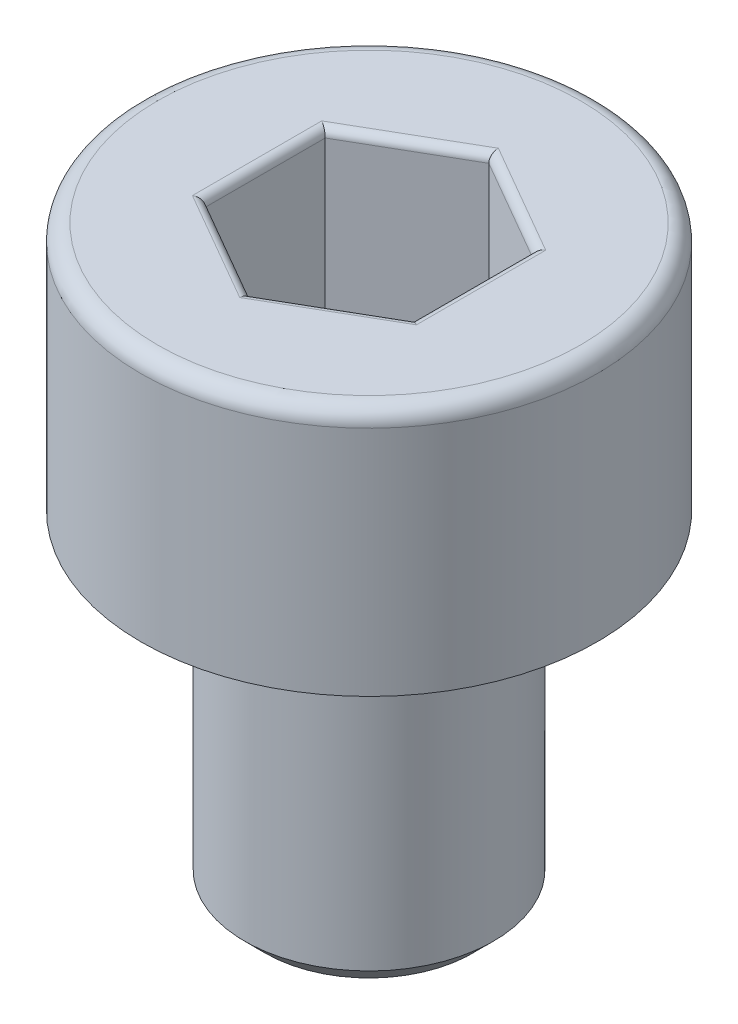
ISO-10303-21;
HEADER;
FILE_DESCRIPTION(('STEP AP214'),'2;1');
FILE_NAME('part.step','',(''),(''),'','','');
FILE_SCHEMA(('AUTOMOTIVE_DESIGN { 1 0 10303 214 1 1 1 1 }'));
ENDSEC;
DATA;
#1=APPLICATION_CONTEXT('core data for automotive mechanical design processes');
#2=APPLICATION_PROTOCOL_DEFINITION('international standard','automotive_design',2000,#1);
#3=PRODUCT_CONTEXT('',#1,'mechanical');
#4=PRODUCT('Part','Part','',(#3));
#5=PRODUCT_RELATED_PRODUCT_CATEGORY('part','',(#4));
#6=PRODUCT_DEFINITION_FORMATION('','',#4);
#7=PRODUCT_DEFINITION_CONTEXT('part definition',#1,'design');
#8=PRODUCT_DEFINITION('design','',#6,#7);
#9=PRODUCT_DEFINITION_SHAPE('','',#8);
#10=(LENGTH_UNIT() NAMED_UNIT(*) SI_UNIT(.MILLI.,.METRE.));
#11=(NAMED_UNIT(*) PLANE_ANGLE_UNIT() SI_UNIT($,.RADIAN.));
#12=(NAMED_UNIT(*) SI_UNIT($,.STERADIAN.) SOLID_ANGLE_UNIT());
#13=UNCERTAINTY_MEASURE_WITH_UNIT(LENGTH_MEASURE(1.E-05),#10,'distance_accuracy_value','');
#14=(GEOMETRIC_REPRESENTATION_CONTEXT(3) GLOBAL_UNCERTAINTY_ASSIGNED_CONTEXT((#13)) GLOBAL_UNIT_ASSIGNED_CONTEXT((#10,
#11,#12)) REPRESENTATION_CONTEXT('',''));
#15=CARTESIAN_POINT('',(0.,0.,0.));
#16=DIRECTION('',(0.,0.,1.));
#17=DIRECTION('',(1.,0.,0.));
#18=AXIS2_PLACEMENT_3D('',#15,#16,#17);
#19=CARTESIAN_POINT('',(0.,-7.,0.));
#20=DIRECTION('',(0.,-1.,0.));
#21=DIRECTION('',(0.,0.,-1.));
#22=AXIS2_PLACEMENT_3D('',#19,#20,#21);
#23=PLANE('',#22);
#24=CARTESIAN_POINT('',(0.,-7.,0.));
#25=DIRECTION('',(0.,-1.,0.));
#26=DIRECTION('',(0.,0.,-1.));
#27=AXIS2_PLACEMENT_3D('',#24,#25,#26);
#28=CIRCLE('',#27,1.25);
#29=CARTESIAN_POINT('',(0.,-7.,-1.25));
#30=VERTEX_POINT('',#29);
#31=EDGE_CURVE('E263',#30,#30,#28,.T.);
#32=ORIENTED_EDGE('',*,*,#31,.T.);
#33=EDGE_LOOP('',(#32));
#34=FACE_BOUND('',#33,.T.);
#35=ADVANCED_FACE('F35',(#34),#23,.T.);
#36=CARTESIAN_POINT('',(0.,0.,0.));
#37=DIRECTION('',(0.,1.,0.));
#38=DIRECTION('',(0.,0.,1.));
#39=AXIS2_PLACEMENT_3D('',#36,#37,#38);
#40=CYLINDRICAL_SURFACE('',#39,1.5);
#41=CARTESIAN_POINT('',(0.,-3.25,0.));
#42=DIRECTION('',(0.,-1.,0.));
#43=DIRECTION('',(0.,0.,-1.));
#44=AXIS2_PLACEMENT_3D('',#41,#42,#43);
#45=CIRCLE('',#44,1.5);
#46=CARTESIAN_POINT('',(0.,-3.25,-1.5));
#47=VERTEX_POINT('',#46);
#48=EDGE_CURVE('E260',#47,#47,#45,.T.);
#49=ORIENTED_EDGE('',*,*,#48,.T.);
#50=EDGE_LOOP('',(#49));
#51=FACE_BOUND('',#50,.T.);
#52=CARTESIAN_POINT('',(0.,-6.75,0.));
#53=DIRECTION('',(0.,-1.,0.));
#54=DIRECTION('',(0.,0.,-1.));
#55=AXIS2_PLACEMENT_3D('',#52,#53,#54);
#56=CIRCLE('',#55,1.5);
#57=CARTESIAN_POINT('',(0.,-6.75,-1.5));
#58=VERTEX_POINT('',#57);
#59=EDGE_CURVE('E257',#58,#58,#56,.F.);
#60=ORIENTED_EDGE('',*,*,#59,.T.);
#61=EDGE_LOOP('',(#60));
#62=FACE_BOUND('',#61,.T.);
#63=ADVANCED_FACE('F289',(#51,#62),#40,.T.);
#64=CARTESIAN_POINT('',(-1.5,-3.,0.));
#65=DIRECTION('',(0.,-1.,0.));
#66=DIRECTION('',(0.,0.,-1.));
#67=AXIS2_PLACEMENT_3D('',#64,#65,#66);
#68=PLANE('',#67);
#69=CARTESIAN_POINT('',(0.,-3.,0.));
#70=DIRECTION('',(0.,-1.,0.));
#71=DIRECTION('',(0.,0.,-1.));
#72=AXIS2_PLACEMENT_3D('',#69,#70,#71);
#73=CIRCLE('',#72,1.75);
#74=CARTESIAN_POINT('',(0.,-3.,-1.75));
#75=VERTEX_POINT('',#74);
#76=EDGE_CURVE('E254',#75,#75,#73,.F.);
#77=ORIENTED_EDGE('',*,*,#76,.T.);
#78=EDGE_LOOP('',(#77));
#79=FACE_BOUND('',#78,.T.);
#80=CARTESIAN_POINT('',(0.,-3.,0.));
#81=DIRECTION('',(0.,1.,0.));
#82=DIRECTION('',(0.,0.,1.));
#83=AXIS2_PLACEMENT_3D('',#80,#81,#82);
#84=CIRCLE('',#83,2.75);
#85=CARTESIAN_POINT('',(0.,-3.,2.75));
#86=VERTEX_POINT('',#85);
#87=EDGE_CURVE('E251',#86,#86,#84,.T.);
#88=ORIENTED_EDGE('',*,*,#87,.F.);
#89=EDGE_LOOP('',(#88));
#90=FACE_BOUND('',#89,.T.);
#91=ADVANCED_FACE('F295',(#79,#90),#68,.T.);
#92=CARTESIAN_POINT('',(0.,0.,0.));
#93=DIRECTION('',(0.,1.,0.));
#94=DIRECTION('',(0.,0.,1.));
#95=AXIS2_PLACEMENT_3D('',#92,#93,#94);
#96=CYLINDRICAL_SURFACE('',#95,2.75);
#97=CARTESIAN_POINT('',(0.,-0.2,0.));
#98=DIRECTION('',(0.,1.,0.));
#99=DIRECTION('',(0.,0.,1.));
#100=AXIS2_PLACEMENT_3D('',#97,#98,#99);
#101=CIRCLE('',#100,2.75);
#102=CARTESIAN_POINT('',(0.,-0.2,2.75));
#103=VERTEX_POINT('',#102);
#104=EDGE_CURVE('E161',#103,#103,#101,.F.);
#105=ORIENTED_EDGE('',*,*,#104,.T.);
#106=EDGE_LOOP('',(#105));
#107=FACE_BOUND('',#106,.T.);
#108=ORIENTED_EDGE('',*,*,#87,.T.);
#109=EDGE_LOOP('',(#108));
#110=FACE_BOUND('',#109,.T.);
#111=ADVANCED_FACE('F305',(#107,#110),#96,.T.);
#112=CARTESIAN_POINT('',(-2.75,0.,0.));
#113=DIRECTION('',(0.,1.,0.));
#114=DIRECTION('',(0.,0.,1.));
#115=AXIS2_PLACEMENT_3D('',#112,#113,#114);
#116=PLANE('',#115);
#117=DIRECTION('',(0.,0.,1.));
#118=VECTOR('',#117,1.);
#119=CARTESIAN_POINT('',(-1.35,0.,-0.721687836487033));
#120=LINE('',#119,#118);
#121=CARTESIAN_POINT('',(-1.35,0.,0.779422863405995));
#122=VERTEX_POINT('',#121);
#123=CARTESIAN_POINT('',(-1.35,0.,-0.779422863405995));
#124=VERTEX_POINT('',#123);
#125=EDGE_CURVE('E177',#122,#124,#120,.F.);
#126=ORIENTED_EDGE('',*,*,#125,.T.);
#127=DIRECTION('',(-0.866025403784439,0.,0.5));
#128=VECTOR('',#127,1.);
#129=CARTESIAN_POINT('',(-0.0500000000000002,0.,-1.52997821335251));
#130=LINE('',#129,#128);
#131=CARTESIAN_POINT('',(0.,0.,-1.55884572681199));
#132=VERTEX_POINT('',#131);
#133=EDGE_CURVE('E136',#124,#132,#130,.F.);
#134=ORIENTED_EDGE('',*,*,#133,.T.);
#135=DIRECTION('',(-0.866025403784439,0.,-0.5));
#136=VECTOR('',#135,1.);
#137=CARTESIAN_POINT('',(1.3,0.,-0.808290376865477));
#138=LINE('',#137,#136);
#139=CARTESIAN_POINT('',(1.35,0.,-0.779422863405995));
#140=VERTEX_POINT('',#139);
#141=EDGE_CURVE('E163',#132,#140,#138,.F.);
#142=ORIENTED_EDGE('',*,*,#141,.T.);
#143=DIRECTION('',(0.,0.,-1.));
#144=VECTOR('',#143,1.);
#145=CARTESIAN_POINT('',(1.35,0.,0.721687836487034));
#146=LINE('',#145,#144);
#147=CARTESIAN_POINT('',(1.35,0.,0.779422863405996));
#148=VERTEX_POINT('',#147);
#149=EDGE_CURVE('E171',#140,#148,#146,.F.);
#150=ORIENTED_EDGE('',*,*,#149,.T.);
#151=DIRECTION('',(0.866025403784439,0.,-0.5));
#152=VECTOR('',#151,1.);
#153=CARTESIAN_POINT('',(0.05,0.,1.52997821335251));
#154=LINE('',#153,#152);
#155=CARTESIAN_POINT('',(0.,0.,1.55884572681199));
#156=VERTEX_POINT('',#155);
#157=EDGE_CURVE('E173',#148,#156,#154,.F.);
#158=ORIENTED_EDGE('',*,*,#157,.T.);
#159=DIRECTION('',(0.866025403784438,0.,0.5));
#160=VECTOR('',#159,1.);
#161=CARTESIAN_POINT('',(-1.3,0.,0.808290376865476));
#162=LINE('',#161,#160);
#163=EDGE_CURVE('E175',#156,#122,#162,.F.);
#164=ORIENTED_EDGE('',*,*,#163,.T.);
#165=EDGE_LOOP('',(#126,#134,#142,#150,#158,#164));
#166=FACE_BOUND('',#165,.T.);
#167=CARTESIAN_POINT('',(0.,0.,0.));
#168=DIRECTION('',(0.,1.,0.));
#169=DIRECTION('',(0.,0.,1.));
#170=AXIS2_PLACEMENT_3D('',#167,#168,#169);
#171=CIRCLE('',#170,2.55);
#172=CARTESIAN_POINT('',(0.,0.,2.55));
#173=VERTEX_POINT('',#172);
#174=EDGE_CURVE('E166',#173,#173,#171,.T.);
#175=ORIENTED_EDGE('',*,*,#174,.T.);
#176=EDGE_LOOP('',(#175));
#177=FACE_BOUND('',#176,.T.);
#178=ADVANCED_FACE('F268',(#166,#177),#116,.T.);
#179=CARTESIAN_POINT('',(0.,-3.,0.));
#180=DIRECTION('',(0.,1.,0.));
#181=DIRECTION('',(0.,0.,1.));
#182=AXIS2_PLACEMENT_3D('',#179,#180,#181);
#183=CONICAL_SURFACE('',#182,1.75,0.785398163397455);
#184=ORIENTED_EDGE('',*,*,#48,.F.);
#185=EDGE_LOOP('',(#184));
#186=FACE_BOUND('',#185,.T.);
#187=ORIENTED_EDGE('',*,*,#76,.F.);
#188=EDGE_LOOP('',(#187));
#189=FACE_BOUND('',#188,.T.);
#190=ADVANCED_FACE('F283',(#186,#189),#183,.T.);
#191=CARTESIAN_POINT('',(0.,-6.75,0.));
#192=DIRECTION('',(0.,1.,0.));
#193=DIRECTION('',(0.,0.,1.));
#194=AXIS2_PLACEMENT_3D('',#191,#192,#193);
#195=CONICAL_SURFACE('',#194,1.5,0.785398163397454);
#196=ORIENTED_EDGE('',*,*,#31,.F.);
#197=EDGE_LOOP('',(#196));
#198=FACE_BOUND('',#197,.T.);
#199=ORIENTED_EDGE('',*,*,#59,.F.);
#200=EDGE_LOOP('',(#199));
#201=FACE_BOUND('',#200,.T.);
#202=ADVANCED_FACE('F273',(#198,#201),#195,.T.);
#203=CARTESIAN_POINT('',(0.,-0.2,0.));
#204=DIRECTION('',(0.,1.,0.));
#205=DIRECTION('',(0.,0.,1.));
#206=AXIS2_PLACEMENT_3D('',#203,#204,#205);
#207=TOROIDAL_SURFACE('',#206,2.55,0.2);
#208=ORIENTED_EDGE('',*,*,#104,.F.);
#209=EDGE_LOOP('',(#208));
#210=FACE_BOUND('',#209,.T.);
#211=ORIENTED_EDGE('',*,*,#174,.F.);
#212=EDGE_LOOP('',(#211));
#213=FACE_BOUND('',#212,.T.);
#214=ADVANCED_FACE('F270',(#210,#213),#207,.T.);
#215=CARTESIAN_POINT('',(1.25,-2.,-0.721687836487033));
#216=DIRECTION('',(0.5,0.,-0.866025403784439));
#217=DIRECTION('',(-0.866025403784439,0.,-0.5));
#218=AXIS2_PLACEMENT_3D('',#215,#216,#217);
#219=PLANE('',#218);
#220=DIRECTION('',(0.,1.,0.));
#221=VECTOR('',#220,1.);
#222=CARTESIAN_POINT('',(1.25,-2.,-0.721687836487033));
#223=LINE('',#222,#221);
#224=CARTESIAN_POINT('',(1.25,-1.9,-0.721687836487033));
#225=VERTEX_POINT('',#224);
#226=CARTESIAN_POINT('',(1.25,-0.1,-0.721687836487033));
#227=VERTEX_POINT('',#226);
#228=EDGE_CURVE('E245',#225,#227,#223,.T.);
#229=ORIENTED_EDGE('',*,*,#228,.T.);
#230=DIRECTION('',(-0.866025403784439,0.,-0.5));
#231=VECTOR('',#230,1.);
#232=CARTESIAN_POINT('',(0.,-0.1,-1.44337567297406));
#233=LINE('',#232,#231);
#234=CARTESIAN_POINT('',(0.,-0.1,-1.44337567297406));
#235=VERTEX_POINT('',#234);
#236=EDGE_CURVE('E197',#227,#235,#233,.T.);
#237=ORIENTED_EDGE('',*,*,#236,.T.);
#238=DIRECTION('',(0.,1.,0.));
#239=VECTOR('',#238,1.);
#240=CARTESIAN_POINT('',(0.,-2.,-1.44337567297406));
#241=LINE('',#240,#239);
#242=CARTESIAN_POINT('',(0.,-1.9,-1.44337567297406));
#243=VERTEX_POINT('',#242);
#244=EDGE_CURVE('E147',#243,#235,#241,.T.);
#245=ORIENTED_EDGE('',*,*,#244,.F.);
#246=DIRECTION('',(-0.866025403784439,0.,-0.5));
#247=VECTOR('',#246,1.);
#248=CARTESIAN_POINT('',(1.25,-1.9,-0.721687836487033));
#249=LINE('',#248,#247);
#250=EDGE_CURVE('E195',#243,#225,#249,.F.);
#251=ORIENTED_EDGE('',*,*,#250,.T.);
#252=EDGE_LOOP('',(#229,#237,#245,#251));
#253=FACE_BOUND('',#252,.T.);
#254=ADVANCED_FACE('F272',(#253),#219,.F.);
#255=CARTESIAN_POINT('',(1.25,-2.,0.721687836487034));
#256=DIRECTION('',(1.,0.,0.));
#257=DIRECTION('',(0.,0.,-1.));
#258=AXIS2_PLACEMENT_3D('',#255,#256,#257);
#259=PLANE('',#258);
#260=DIRECTION('',(0.,1.,0.));
#261=VECTOR('',#260,1.);
#262=CARTESIAN_POINT('',(1.25,-2.,0.721687836487034));
#263=LINE('',#262,#261);
#264=CARTESIAN_POINT('',(1.25,-1.9,0.721687836487034));
#265=VERTEX_POINT('',#264);
#266=CARTESIAN_POINT('',(1.25,-0.1,0.721687836487034));
#267=VERTEX_POINT('',#266);
#268=EDGE_CURVE('E242',#265,#267,#263,.T.);
#269=ORIENTED_EDGE('',*,*,#268,.T.);
#270=DIRECTION('',(0.,0.,-1.));
#271=VECTOR('',#270,1.);
#272=CARTESIAN_POINT('',(1.25,-0.1,-0.721687836487033));
#273=LINE('',#272,#271);
#274=EDGE_CURVE('E193',#267,#227,#273,.T.);
#275=ORIENTED_EDGE('',*,*,#274,.T.);
#276=ORIENTED_EDGE('',*,*,#228,.F.);
#277=DIRECTION('',(0.,0.,-1.));
#278=VECTOR('',#277,1.);
#279=CARTESIAN_POINT('',(1.25,-1.9,0.721687836487034));
#280=LINE('',#279,#278);
#281=EDGE_CURVE('E190',#225,#265,#280,.F.);
#282=ORIENTED_EDGE('',*,*,#281,.T.);
#283=EDGE_LOOP('',(#269,#275,#276,#282));
#284=FACE_BOUND('',#283,.T.);
#285=ADVANCED_FACE('F280',(#284),#259,.F.);
#286=CARTESIAN_POINT('',(0.,-2.,1.44337567297407));
#287=DIRECTION('',(0.5,0.,0.866025403784439));
#288=DIRECTION('',(0.866025403784439,0.,-0.5));
#289=AXIS2_PLACEMENT_3D('',#286,#287,#288);
#290=PLANE('',#289);
#291=DIRECTION('',(0.,1.,0.));
#292=VECTOR('',#291,1.);
#293=CARTESIAN_POINT('',(0.,-2.,1.44337567297407));
#294=LINE('',#293,#292);
#295=CARTESIAN_POINT('',(0.,-1.9,1.44337567297407));
#296=VERTEX_POINT('',#295);
#297=CARTESIAN_POINT('',(0.,-0.1,1.44337567297407));
#298=VERTEX_POINT('',#297);
#299=EDGE_CURVE('E239',#296,#298,#294,.T.);
#300=ORIENTED_EDGE('',*,*,#299,.T.);
#301=DIRECTION('',(0.866025403784439,0.,-0.5));
#302=VECTOR('',#301,1.);
#303=CARTESIAN_POINT('',(1.25,-0.1,0.721687836487034));
#304=LINE('',#303,#302);
#305=EDGE_CURVE('E188',#298,#267,#304,.T.);
#306=ORIENTED_EDGE('',*,*,#305,.T.);
#307=ORIENTED_EDGE('',*,*,#268,.F.);
#308=DIRECTION('',(0.866025403784439,0.,-0.5));
#309=VECTOR('',#308,1.);
#310=CARTESIAN_POINT('',(0.,-1.9,1.44337567297407));
#311=LINE('',#310,#309);
#312=EDGE_CURVE('E186',#265,#296,#311,.F.);
#313=ORIENTED_EDGE('',*,*,#312,.T.);
#314=EDGE_LOOP('',(#300,#306,#307,#313));
#315=FACE_BOUND('',#314,.T.);
#316=ADVANCED_FACE('F329',(#315),#290,.F.);
#317=CARTESIAN_POINT('',(-1.25,-2.,0.721687836487033));
#318=DIRECTION('',(-0.5,0.,0.866025403784439));
#319=DIRECTION('',(0.866025403784438,0.,0.5));
#320=AXIS2_PLACEMENT_3D('',#317,#318,#319);
#321=PLANE('',#320);
#322=DIRECTION('',(0.,1.,0.));
#323=VECTOR('',#322,1.);
#324=CARTESIAN_POINT('',(-1.25,-2.,0.721687836487033));
#325=LINE('',#324,#323);
#326=CARTESIAN_POINT('',(-1.25,-1.9,0.721687836487033));
#327=VERTEX_POINT('',#326);
#328=CARTESIAN_POINT('',(-1.25,-0.1,0.721687836487033));
#329=VERTEX_POINT('',#328);
#330=EDGE_CURVE('E130',#327,#329,#325,.T.);
#331=ORIENTED_EDGE('',*,*,#330,.T.);
#332=DIRECTION('',(0.866025403784438,0.,0.5));
#333=VECTOR('',#332,1.);
#334=CARTESIAN_POINT('',(0.,-0.1,1.44337567297407));
#335=LINE('',#334,#333);
#336=EDGE_CURVE('E184',#329,#298,#335,.T.);
#337=ORIENTED_EDGE('',*,*,#336,.T.);
#338=ORIENTED_EDGE('',*,*,#299,.F.);
#339=DIRECTION('',(0.866025403784438,0.,0.5));
#340=VECTOR('',#339,1.);
#341=CARTESIAN_POINT('',(-1.25,-1.9,0.721687836487033));
#342=LINE('',#341,#340);
#343=EDGE_CURVE('E182',#296,#327,#342,.F.);
#344=ORIENTED_EDGE('',*,*,#343,.T.);
#345=EDGE_LOOP('',(#331,#337,#338,#344));
#346=FACE_BOUND('',#345,.T.);
#347=ADVANCED_FACE('F236',(#346),#321,.F.);
#348=CARTESIAN_POINT('',(-1.25,-2.,-0.721687836487033));
#349=DIRECTION('',(-1.,0.,0.));
#350=DIRECTION('',(0.,0.,1.));
#351=AXIS2_PLACEMENT_3D('',#348,#349,#350);
#352=PLANE('',#351);
#353=DIRECTION('',(0.,1.,0.));
#354=VECTOR('',#353,1.);
#355=CARTESIAN_POINT('',(-1.25,-2.,-0.721687836487033));
#356=LINE('',#355,#354);
#357=CARTESIAN_POINT('',(-1.25,-1.9,-0.721687836487033));
#358=VERTEX_POINT('',#357);
#359=CARTESIAN_POINT('',(-1.25,-0.1,-0.721687836487033));
#360=VERTEX_POINT('',#359);
#361=EDGE_CURVE('E128',#358,#360,#356,.T.);
#362=ORIENTED_EDGE('',*,*,#361,.T.);
#363=DIRECTION('',(0.,0.,1.));
#364=VECTOR('',#363,1.);
#365=CARTESIAN_POINT('',(-1.25,-0.1,0.721687836487033));
#366=LINE('',#365,#364);
#367=EDGE_CURVE('E135',#360,#329,#366,.T.);
#368=ORIENTED_EDGE('',*,*,#367,.T.);
#369=ORIENTED_EDGE('',*,*,#330,.F.);
#370=DIRECTION('',(0.,0.,1.));
#371=VECTOR('',#370,1.);
#372=CARTESIAN_POINT('',(-1.25,-1.9,-0.721687836487033));
#373=LINE('',#372,#371);
#374=EDGE_CURVE('E125',#327,#358,#373,.F.);
#375=ORIENTED_EDGE('',*,*,#374,.T.);
#376=EDGE_LOOP('',(#362,#368,#369,#375));
#377=FACE_BOUND('',#376,.T.);
#378=ADVANCED_FACE('F127',(#377),#352,.F.);
#379=CARTESIAN_POINT('',(0.,-2.,-1.44337567297406));
#380=DIRECTION('',(-0.5,0.,-0.866025403784439));
#381=DIRECTION('',(-0.866025403784439,0.,0.5));
#382=AXIS2_PLACEMENT_3D('',#379,#380,#381);
#383=PLANE('',#382);
#384=ORIENTED_EDGE('',*,*,#244,.T.);
#385=DIRECTION('',(-0.866025403784439,0.,0.5));
#386=VECTOR('',#385,1.);
#387=CARTESIAN_POINT('',(-1.25,-0.1,-0.721687836487032));
#388=LINE('',#387,#386);
#389=EDGE_CURVE('E146',#235,#360,#388,.T.);
#390=ORIENTED_EDGE('',*,*,#389,.T.);
#391=ORIENTED_EDGE('',*,*,#361,.F.);
#392=DIRECTION('',(-0.866025403784439,0.,0.5));
#393=VECTOR('',#392,1.);
#394=CARTESIAN_POINT('',(0.,-1.9,-1.44337567297406));
#395=LINE('',#394,#393);
#396=EDGE_CURVE('E143',#358,#243,#395,.F.);
#397=ORIENTED_EDGE('',*,*,#396,.T.);
#398=EDGE_LOOP('',(#384,#390,#391,#397));
#399=FACE_BOUND('',#398,.T.);
#400=ADVANCED_FACE('F141',(#399),#383,.F.);
#401=CARTESIAN_POINT('',(1.25,-2.,-0.721687836487033));
#402=DIRECTION('',(0.,-1.,0.));
#403=DIRECTION('',(0.,0.,-1.));
#404=AXIS2_PLACEMENT_3D('',#401,#402,#403);
#405=PLANE('',#404);
#406=DIRECTION('',(0.866025403784439,0.,-0.5));
#407=VECTOR('',#406,1.);
#408=CARTESIAN_POINT('',(1.2,-2.,0.63508529610859));
#409=LINE('',#408,#407);
#410=CARTESIAN_POINT('',(0.,-2.,1.32790561913614));
#411=VERTEX_POINT('',#410);
#412=CARTESIAN_POINT('',(1.15,-2.,0.663952809568071));
#413=VERTEX_POINT('',#412);
#414=EDGE_CURVE('E44',#411,#413,#409,.T.);
#415=ORIENTED_EDGE('',*,*,#414,.T.);
#416=DIRECTION('',(0.,0.,-1.));
#417=VECTOR('',#416,1.);
#418=CARTESIAN_POINT('',(1.15,-2.,-0.721687836487033));
#419=LINE('',#418,#417);
#420=CARTESIAN_POINT('',(1.15,-2.,-0.66395280956807));
#421=VERTEX_POINT('',#420);
#422=EDGE_CURVE('E11',#413,#421,#419,.T.);
#423=ORIENTED_EDGE('',*,*,#422,.T.);
#424=DIRECTION('',(-0.866025403784439,0.,-0.5));
#425=VECTOR('',#424,1.);
#426=CARTESIAN_POINT('',(-0.0500000000000001,-2.,-1.35677313259562));
#427=LINE('',#426,#425);
#428=CARTESIAN_POINT('',(0.,-2.,-1.32790561913614));
#429=VERTEX_POINT('',#428);
#430=EDGE_CURVE('E199',#421,#429,#427,.T.);
#431=ORIENTED_EDGE('',*,*,#430,.T.);
#432=DIRECTION('',(-0.866025403784439,0.,0.5));
#433=VECTOR('',#432,1.);
#434=CARTESIAN_POINT('',(-1.2,-2.,-0.635085296108588));
#435=LINE('',#434,#433);
#436=CARTESIAN_POINT('',(-1.15,-2.,-0.66395280956807));
#437=VERTEX_POINT('',#436);
#438=EDGE_CURVE('E201',#429,#437,#435,.T.);
#439=ORIENTED_EDGE('',*,*,#438,.T.);
#440=DIRECTION('',(0.,0.,1.));
#441=VECTOR('',#440,1.);
#442=CARTESIAN_POINT('',(-1.15,-2.,0.721687836487033));
#443=LINE('',#442,#441);
#444=CARTESIAN_POINT('',(-1.15,-2.,0.66395280956807));
#445=VERTEX_POINT('',#444);
#446=EDGE_CURVE('E152',#437,#445,#443,.T.);
#447=ORIENTED_EDGE('',*,*,#446,.T.);
#448=DIRECTION('',(0.866025403784438,0.,0.5));
#449=VECTOR('',#448,1.);
#450=CARTESIAN_POINT('',(0.0499999999999999,-2.,1.35677313259562));
#451=LINE('',#450,#449);
#452=EDGE_CURVE('E55',#445,#411,#451,.T.);
#453=ORIENTED_EDGE('',*,*,#452,.T.);
#454=EDGE_LOOP('',(#415,#423,#431,#439,#447,#453));
#455=FACE_BOUND('',#454,.T.);
#456=ADVANCED_FACE('F324',(#455),#405,.F.);
#457=CARTESIAN_POINT('',(0.05,-0.1,1.52997821335251));
#458=DIRECTION('',(-0.866025403784439,0.,0.5));
#459=DIRECTION('',(0.5,0.,0.866025403784439));
#460=AXIS2_PLACEMENT_3D('',#457,#458,#459);
#461=CYLINDRICAL_SURFACE('',#460,0.1);
#462=CARTESIAN_POINT('',(0.,-0.1,1.55884572681199));
#463=DIRECTION('',(-1.,0.,0.));
#464=DIRECTION('',(0.,0.,-1.));
#465=AXIS2_PLACEMENT_3D('',#462,#463,#464);
#466=ELLIPSE('',#465,0.115470053837925,0.1);
#467=EDGE_CURVE('E216',#156,#298,#466,.T.);
#468=ORIENTED_EDGE('',*,*,#467,.F.);
#469=ORIENTED_EDGE('',*,*,#157,.F.);
#470=CARTESIAN_POINT('',(1.35,-0.1,0.779422863405997));
#471=DIRECTION('',(-0.5,0.,0.866025403784438));
#472=DIRECTION('',(-0.866025403784438,0.,-0.5));
#473=AXIS2_PLACEMENT_3D('',#470,#471,#472);
#474=ELLIPSE('',#473,0.115470053837925,0.1);
#475=EDGE_CURVE('E219',#267,#148,#474,.F.);
#476=ORIENTED_EDGE('',*,*,#475,.F.);
#477=ORIENTED_EDGE('',*,*,#305,.F.);
#478=EDGE_LOOP('',(#468,#469,#476,#477));
#479=FACE_BOUND('',#478,.T.);
#480=ADVANCED_FACE('F336',(#479),#461,.T.);
#481=CARTESIAN_POINT('',(1.35,-0.1,0.721687836487034));
#482=DIRECTION('',(0.,0.,1.));
#483=DIRECTION('',(1.,0.,0.));
#484=AXIS2_PLACEMENT_3D('',#481,#482,#483);
#485=CYLINDRICAL_SURFACE('',#484,0.1);
#486=ORIENTED_EDGE('',*,*,#475,.T.);
#487=ORIENTED_EDGE('',*,*,#149,.F.);
#488=CARTESIAN_POINT('',(1.35,-0.1,-0.779422863405995));
#489=DIRECTION('',(0.5,0.,0.866025403784439));
#490=DIRECTION('',(-0.866025403784439,0.,0.5));
#491=AXIS2_PLACEMENT_3D('',#488,#489,#490);
#492=ELLIPSE('',#491,0.115470053837925,0.1);
#493=EDGE_CURVE('E213',#227,#140,#492,.F.);
#494=ORIENTED_EDGE('',*,*,#493,.F.);
#495=ORIENTED_EDGE('',*,*,#274,.F.);
#496=EDGE_LOOP('',(#486,#487,#494,#495));
#497=FACE_BOUND('',#496,.T.);
#498=ADVANCED_FACE('F340',(#497),#485,.T.);
#499=CARTESIAN_POINT('',(-1.3,-0.1,0.808290376865476));
#500=DIRECTION('',(-0.866025403784438,0.,-0.5));
#501=DIRECTION('',(-0.5,0.,0.866025403784439));
#502=AXIS2_PLACEMENT_3D('',#499,#500,#501);
#503=CYLINDRICAL_SURFACE('',#502,0.1);
#504=ORIENTED_EDGE('',*,*,#467,.T.);
#505=ORIENTED_EDGE('',*,*,#336,.F.);
#506=CARTESIAN_POINT('',(-1.35,-0.1,0.779422863405995));
#507=DIRECTION('',(-0.5,0.,-0.866025403784439));
#508=DIRECTION('',(0.866025403784439,0.,-0.5));
#509=AXIS2_PLACEMENT_3D('',#506,#507,#508);
#510=ELLIPSE('',#509,0.115470053837925,0.1);
#511=EDGE_CURVE('E210',#122,#329,#510,.T.);
#512=ORIENTED_EDGE('',*,*,#511,.F.);
#513=ORIENTED_EDGE('',*,*,#163,.F.);
#514=EDGE_LOOP('',(#504,#505,#512,#513));
#515=FACE_BOUND('',#514,.T.);
#516=ADVANCED_FACE('F346',(#515),#503,.T.);
#517=CARTESIAN_POINT('',(1.3,-0.1,-0.808290376865477));
#518=DIRECTION('',(0.866025403784439,0.,0.5));
#519=DIRECTION('',(0.5,0.,-0.866025403784439));
#520=AXIS2_PLACEMENT_3D('',#517,#518,#519);
#521=CYLINDRICAL_SURFACE('',#520,0.1);
#522=ORIENTED_EDGE('',*,*,#493,.T.);
#523=ORIENTED_EDGE('',*,*,#141,.F.);
#524=CARTESIAN_POINT('',(0.,-0.1,-1.55884572681199));
#525=DIRECTION('',(1.,0.,0.));
#526=DIRECTION('',(0.,0.,-1.));
#527=AXIS2_PLACEMENT_3D('',#524,#525,#526);
#528=ELLIPSE('',#527,0.115470053837925,0.1);
#529=EDGE_CURVE('E208',#235,#132,#528,.F.);
#530=ORIENTED_EDGE('',*,*,#529,.F.);
#531=ORIENTED_EDGE('',*,*,#236,.F.);
#532=EDGE_LOOP('',(#522,#523,#530,#531));
#533=FACE_BOUND('',#532,.T.);
#534=ADVANCED_FACE('F376',(#533),#521,.T.);
#535=CARTESIAN_POINT('',(-1.35,-0.1,-0.721687836487033));
#536=DIRECTION('',(0.,0.,-1.));
#537=DIRECTION('',(-1.,0.,0.));
#538=AXIS2_PLACEMENT_3D('',#535,#536,#537);
#539=CYLINDRICAL_SURFACE('',#538,0.1);
#540=ORIENTED_EDGE('',*,*,#511,.T.);
#541=ORIENTED_EDGE('',*,*,#367,.F.);
#542=CARTESIAN_POINT('',(-1.35,-0.1,-0.779422863405995));
#543=DIRECTION('',(0.5,0.,-0.866025403784439));
#544=DIRECTION('',(0.866025403784439,0.,0.5));
#545=AXIS2_PLACEMENT_3D('',#542,#543,#544);
#546=ELLIPSE('',#545,0.115470053837925,0.1);
#547=EDGE_CURVE('E206',#124,#360,#546,.T.);
#548=ORIENTED_EDGE('',*,*,#547,.F.);
#549=ORIENTED_EDGE('',*,*,#125,.F.);
#550=EDGE_LOOP('',(#540,#541,#548,#549));
#551=FACE_BOUND('',#550,.T.);
#552=ADVANCED_FACE('F371',(#551),#539,.T.);
#553=CARTESIAN_POINT('',(-0.05,-0.1,-1.52997821335251));
#554=DIRECTION('',(0.866025403784439,0.,-0.5));
#555=DIRECTION('',(-0.5,0.,-0.866025403784439));
#556=AXIS2_PLACEMENT_3D('',#553,#554,#555);
#557=CYLINDRICAL_SURFACE('',#556,0.1);
#558=ORIENTED_EDGE('',*,*,#529,.T.);
#559=ORIENTED_EDGE('',*,*,#133,.F.);
#560=ORIENTED_EDGE('',*,*,#547,.T.);
#561=ORIENTED_EDGE('',*,*,#389,.F.);
#562=EDGE_LOOP('',(#558,#559,#560,#561));
#563=FACE_BOUND('',#562,.T.);
#564=ADVANCED_FACE('F367',(#563),#557,.T.);
#565=CARTESIAN_POINT('',(-1.15,-1.9,-0.721687836487033));
#566=DIRECTION('',(0.,0.,-1.));
#567=DIRECTION('',(-1.,0.,0.));
#568=AXIS2_PLACEMENT_3D('',#565,#566,#567);
#569=CYLINDRICAL_SURFACE('',#568,0.1);
#570=CARTESIAN_POINT('',(-1.15,-1.9,-0.663952809568069));
#571=DIRECTION('',(0.5,0.,-0.866025403784439));
#572=DIRECTION('',(-0.866025403784439,0.,-0.5));
#573=AXIS2_PLACEMENT_3D('',#570,#571,#572);
#574=ELLIPSE('',#573,0.115470053837925,0.1);
#575=EDGE_CURVE('E151',#358,#437,#574,.F.);
#576=ORIENTED_EDGE('',*,*,#575,.F.);
#577=ORIENTED_EDGE('',*,*,#374,.F.);
#578=CARTESIAN_POINT('',(-1.15,-1.9,0.66395280956807));
#579=DIRECTION('',(-0.5,0.,-0.866025403784439));
#580=DIRECTION('',(-0.866025403784439,0.,0.5));
#581=AXIS2_PLACEMENT_3D('',#578,#579,#580);
#582=ELLIPSE('',#581,0.115470053837925,0.1);
#583=EDGE_CURVE('E39',#445,#327,#582,.T.);
#584=ORIENTED_EDGE('',*,*,#583,.F.);
#585=ORIENTED_EDGE('',*,*,#446,.F.);
#586=EDGE_LOOP('',(#576,#577,#584,#585));
#587=FACE_BOUND('',#586,.T.);
#588=ADVANCED_FACE('F37',(#587),#569,.F.);
#589=CARTESIAN_POINT('',(0.0499999999999988,-1.9,1.35677313259562));
#590=DIRECTION('',(-0.866025403784438,0.,-0.5));
#591=DIRECTION('',(-0.5,0.,0.866025403784439));
#592=AXIS2_PLACEMENT_3D('',#589,#590,#591);
#593=CYLINDRICAL_SURFACE('',#592,0.1);
#594=ORIENTED_EDGE('',*,*,#583,.T.);
#595=ORIENTED_EDGE('',*,*,#343,.F.);
#596=CARTESIAN_POINT('',(0.,-1.9,1.32790561913614));
#597=DIRECTION('',(-1.,0.,0.));
#598=DIRECTION('',(0.,0.,1.));
#599=AXIS2_PLACEMENT_3D('',#596,#597,#598);
#600=ELLIPSE('',#599,0.115470053837925,0.1);
#601=EDGE_CURVE('E155',#411,#296,#600,.T.);
#602=ORIENTED_EDGE('',*,*,#601,.F.);
#603=ORIENTED_EDGE('',*,*,#452,.F.);
#604=EDGE_LOOP('',(#594,#595,#602,#603));
#605=FACE_BOUND('',#604,.T.);
#606=ADVANCED_FACE('F233',(#605),#593,.F.);
#607=CARTESIAN_POINT('',(0.675,-1.9,-1.71761705083914));
#608=DIRECTION('',(0.866025403784439,0.,-0.5));
#609=DIRECTION('',(-0.5,0.,-0.866025403784439));
#610=AXIS2_PLACEMENT_3D('',#607,#608,#609);
#611=CYLINDRICAL_SURFACE('',#610,0.1);
#612=ORIENTED_EDGE('',*,*,#575,.T.);
#613=ORIENTED_EDGE('',*,*,#438,.F.);
#614=CARTESIAN_POINT('',(0.,-1.9,-1.32790561913614));
#615=DIRECTION('',(1.,0.,0.));
#616=DIRECTION('',(0.,0.,-1.));
#617=AXIS2_PLACEMENT_3D('',#614,#615,#616);
#618=ELLIPSE('',#617,0.115470053837925,0.1);
#619=EDGE_CURVE('E159',#243,#429,#618,.F.);
#620=ORIENTED_EDGE('',*,*,#619,.F.);
#621=ORIENTED_EDGE('',*,*,#396,.F.);
#622=EDGE_LOOP('',(#612,#613,#620,#621));
#623=FACE_BOUND('',#622,.T.);
#624=ADVANCED_FACE('F157',(#623),#611,.F.);
#625=CARTESIAN_POINT('',(1.825,-1.9,0.274241377865074));
#626=DIRECTION('',(-0.866025403784439,0.,0.5));
#627=DIRECTION('',(0.5,0.,0.866025403784439));
#628=AXIS2_PLACEMENT_3D('',#625,#626,#627);
#629=CYLINDRICAL_SURFACE('',#628,0.1);
#630=ORIENTED_EDGE('',*,*,#601,.T.);
#631=ORIENTED_EDGE('',*,*,#312,.F.);
#632=CARTESIAN_POINT('',(1.15,-1.9,0.663952809568072));
#633=DIRECTION('',(-0.5,0.,0.866025403784438));
#634=DIRECTION('',(0.866025403784438,0.,0.5));
#635=AXIS2_PLACEMENT_3D('',#632,#633,#634);
#636=ELLIPSE('',#635,0.115470053837925,0.1);
#637=EDGE_CURVE('E224',#413,#265,#636,.T.);
#638=ORIENTED_EDGE('',*,*,#637,.F.);
#639=ORIENTED_EDGE('',*,*,#414,.F.);
#640=EDGE_LOOP('',(#630,#631,#638,#639));
#641=FACE_BOUND('',#640,.T.);
#642=ADVANCED_FACE('F230',(#641),#629,.F.);
#643=CARTESIAN_POINT('',(1.2,-1.9,-0.635085296108589));
#644=DIRECTION('',(0.866025403784439,0.,0.5));
#645=DIRECTION('',(0.5,0.,-0.866025403784439));
#646=AXIS2_PLACEMENT_3D('',#643,#644,#645);
#647=CYLINDRICAL_SURFACE('',#646,0.1);
#648=ORIENTED_EDGE('',*,*,#619,.T.);
#649=ORIENTED_EDGE('',*,*,#430,.F.);
#650=CARTESIAN_POINT('',(1.15,-1.9,-0.66395280956807));
#651=DIRECTION('',(0.5,0.,0.866025403784439));
#652=DIRECTION('',(-0.866025403784439,0.,0.5));
#653=AXIS2_PLACEMENT_3D('',#650,#651,#652);
#654=ELLIPSE('',#653,0.115470053837925,0.1);
#655=EDGE_CURVE('E222',#225,#421,#654,.F.);
#656=ORIENTED_EDGE('',*,*,#655,.F.);
#657=ORIENTED_EDGE('',*,*,#250,.F.);
#658=EDGE_LOOP('',(#648,#649,#656,#657));
#659=FACE_BOUND('',#658,.T.);
#660=ADVANCED_FACE('F355',(#659),#647,.F.);
#661=CARTESIAN_POINT('',(1.15,-1.9,-0.721687836487033));
#662=DIRECTION('',(0.,0.,1.));
#663=DIRECTION('',(1.,0.,0.));
#664=AXIS2_PLACEMENT_3D('',#661,#662,#663);
#665=CYLINDRICAL_SURFACE('',#664,0.1);
#666=ORIENTED_EDGE('',*,*,#637,.T.);
#667=ORIENTED_EDGE('',*,*,#281,.F.);
#668=ORIENTED_EDGE('',*,*,#655,.T.);
#669=ORIENTED_EDGE('',*,*,#422,.F.);
#670=EDGE_LOOP('',(#666,#667,#668,#669));
#671=FACE_BOUND('',#670,.T.);
#672=ADVANCED_FACE('F352',(#671),#665,.F.);
#673=CLOSED_SHELL('',(#35,#63,#91,#111,#178,#190,#202,#214,#254,#285,#316,#347,#378,#400,#456,
#480,#498,#516,#534,#552,#564,#588,#606,#624,#642,#660,#672));
#674=MANIFOLD_SOLID_BREP('B2',#673);
#675=ADVANCED_BREP_SHAPE_REPRESENTATION('',(#18,#674),#14);
#676=SHAPE_DEFINITION_REPRESENTATION(#9,#675);
ENDSEC;
END-ISO-10303-21;
